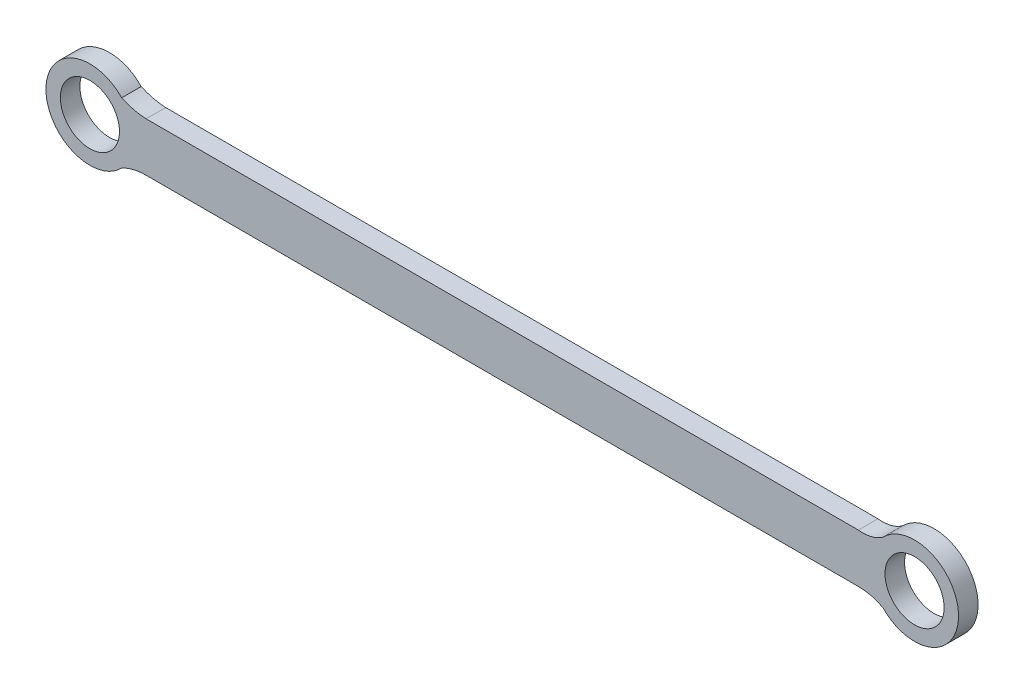
ISO-10303-21;
HEADER;
FILE_DESCRIPTION(('STEP AP214'),'2;1');
FILE_NAME('part.step','',(''),(''),'','','');
FILE_SCHEMA(('AUTOMOTIVE_DESIGN { 1 0 10303 214 1 1 1 1 }'));
ENDSEC;
DATA;
#1=APPLICATION_CONTEXT('core data for automotive mechanical design processes');
#2=APPLICATION_PROTOCOL_DEFINITION('international standard','automotive_design',2000,#1);
#3=PRODUCT_CONTEXT('',#1,'mechanical');
#4=PRODUCT('Part','Part','',(#3));
#5=PRODUCT_RELATED_PRODUCT_CATEGORY('part','',(#4));
#6=PRODUCT_DEFINITION_FORMATION('','',#4);
#7=PRODUCT_DEFINITION_CONTEXT('part definition',#1,'design');
#8=PRODUCT_DEFINITION('design','',#6,#7);
#9=PRODUCT_DEFINITION_SHAPE('','',#8);
#10=(LENGTH_UNIT() NAMED_UNIT(*) SI_UNIT(.MILLI.,.METRE.));
#11=(NAMED_UNIT(*) PLANE_ANGLE_UNIT() SI_UNIT($,.RADIAN.));
#12=(NAMED_UNIT(*) SI_UNIT($,.STERADIAN.) SOLID_ANGLE_UNIT());
#13=UNCERTAINTY_MEASURE_WITH_UNIT(LENGTH_MEASURE(1.E-05),#10,'distance_accuracy_value','');
#14=(GEOMETRIC_REPRESENTATION_CONTEXT(3) GLOBAL_UNCERTAINTY_ASSIGNED_CONTEXT((#13)) GLOBAL_UNIT_ASSIGNED_CONTEXT((#10,
#11,#12)) REPRESENTATION_CONTEXT('',''));
#15=CARTESIAN_POINT('',(0.,0.,0.));
#16=DIRECTION('',(0.,0.,1.));
#17=DIRECTION('',(1.,0.,0.));
#18=AXIS2_PLACEMENT_3D('',#15,#16,#17);
#19=CARTESIAN_POINT('',(82.9284754578231,11.5187030014296,4.));
#20=DIRECTION('',(0.,0.,1.));
#21=DIRECTION('',(1.,0.,0.));
#22=AXIS2_PLACEMENT_3D('',#19,#20,#21);
#23=PLANE('',#22);
#24=CARTESIAN_POINT('',(-75.25189842,-0.499050790722363,4.));
#25=DIRECTION('',(0.,0.,1.));
#26=DIRECTION('',(1.,0.,0.));
#27=AXIS2_PLACEMENT_3D('',#24,#25,#26);
#28=CIRCLE('',#27,6.05);
#29=CARTESIAN_POINT('',(-69.20189842,-0.499050790722363,4.));
#30=VERTEX_POINT('',#29);
#31=EDGE_CURVE('E175',#30,#30,#28,.T.);
#32=ORIENTED_EDGE('',*,*,#31,.F.);
#33=EDGE_LOOP('',(#32));
#34=FACE_BOUND('',#33,.T.);
#35=CARTESIAN_POINT('',(82.9284754578231,11.5187030014296,4.));
#36=DIRECTION('',(0.,0.,-1.));
#37=DIRECTION('',(1.,0.,0.));
#38=AXIS2_PLACEMENT_3D('',#35,#36,#37);
#39=CIRCLE('',#38,7.07890775212126);
#40=CARTESIAN_POINT('',(87.,5.7278807052877,4.));
#41=VERTEX_POINT('',#40);
#42=CARTESIAN_POINT('',(82.,4.50094920927764,4.));
#43=VERTEX_POINT('',#42);
#44=EDGE_CURVE('E168',#41,#43,#39,.T.);
#45=ORIENTED_EDGE('',*,*,#44,.T.);
#46=DIRECTION('',(-1.,0.,0.));
#47=VECTOR('',#46,1.);
#48=CARTESIAN_POINT('',(82.,4.50094920927764,4.));
#49=LINE('',#48,#47);
#50=CARTESIAN_POINT('',(-63.75,4.50094920927762,4.));
#51=VERTEX_POINT('',#50);
#52=EDGE_CURVE('E102',#43,#51,#49,.T.);
#53=ORIENTED_EDGE('',*,*,#52,.T.);
#54=CARTESIAN_POINT('',(-63.1540249134477,17.7700732969457,4.));
#55=DIRECTION('',(0.,0.,-1.));
#56=DIRECTION('',(1.,0.,0.));
#57=AXIS2_PLACEMENT_3D('',#54,#55,#56);
#58=CIRCLE('',#57,13.2825012839346);
#59=CARTESIAN_POINT('',(-68.75,5.72391610104252,4.));
#60=VERTEX_POINT('',#59);
#61=EDGE_CURVE('E158',#51,#60,#58,.T.);
#62=ORIENTED_EDGE('',*,*,#61,.T.);
#63=CARTESIAN_POINT('',(-75.25189842,-0.499050790722363,4.));
#64=DIRECTION('',(0.,0.,1.));
#65=DIRECTION('',(1.,0.,0.));
#66=AXIS2_PLACEMENT_3D('',#63,#64,#65);
#67=CIRCLE('',#66,9.);
#68=CARTESIAN_POINT('',(-68.75,-6.72201768248724,4.));
#69=VERTEX_POINT('',#68);
#70=EDGE_CURVE('E154',#60,#69,#67,.T.);
#71=ORIENTED_EDGE('',*,*,#70,.T.);
#72=CARTESIAN_POINT('',(-63.8571956674328,-15.8933188266036,4.));
#73=DIRECTION('',(0.,0.,-1.));
#74=DIRECTION('',(1.,0.,0.));
#75=AXIS2_PLACEMENT_3D('',#72,#73,#74);
#76=CIRCLE('',#75,10.3948207734842);
#77=CARTESIAN_POINT('',(-63.75,-5.49905079072237,4.));
#78=VERTEX_POINT('',#77);
#79=EDGE_CURVE('E121',#69,#78,#76,.T.);
#80=ORIENTED_EDGE('',*,*,#79,.T.);
#81=DIRECTION('',(1.,0.,0.));
#82=VECTOR('',#81,1.);
#83=CARTESIAN_POINT('',(-63.75,-5.49905079072237,4.));
#84=LINE('',#83,#82);
#85=CARTESIAN_POINT('',(82.,-5.49905079072237,4.));
#86=VERTEX_POINT('',#85);
#87=EDGE_CURVE('E115',#78,#86,#84,.T.);
#88=ORIENTED_EDGE('',*,*,#87,.T.);
#89=CARTESIAN_POINT('',(82.,-16.3005344033348,4.));
#90=DIRECTION('',(0.,0.,-1.));
#91=DIRECTION('',(1.,0.,0.));
#92=AXIS2_PLACEMENT_3D('',#89,#90,#91);
#93=CIRCLE('',#92,10.8014836126124);
#94=CARTESIAN_POINT('',(87.,-6.72598228673243,4.));
#95=VERTEX_POINT('',#94);
#96=EDGE_CURVE('E119',#86,#95,#93,.T.);
#97=ORIENTED_EDGE('',*,*,#96,.T.);
#98=CARTESIAN_POINT('',(93.49810158,-0.499050790722363,4.));
#99=DIRECTION('',(0.,0.,1.));
#100=DIRECTION('',(1.,0.,0.));
#101=AXIS2_PLACEMENT_3D('',#98,#99,#100);
#102=CIRCLE('',#101,9.00000000000002);
#103=EDGE_CURVE('E59',#95,#41,#102,.T.);
#104=ORIENTED_EDGE('',*,*,#103,.T.);
#105=EDGE_LOOP('',(#45,#53,#62,#71,#80,#88,#97,#104));
#106=FACE_BOUND('',#105,.T.);
#107=CARTESIAN_POINT('',(93.49810158,-0.499050790722363,4.));
#108=DIRECTION('',(0.,0.,1.));
#109=DIRECTION('',(1.,0.,0.));
#110=AXIS2_PLACEMENT_3D('',#107,#108,#109);
#111=CIRCLE('',#110,6.05);
#112=CARTESIAN_POINT('',(99.54810158,-0.499050790722363,4.));
#113=VERTEX_POINT('',#112);
#114=EDGE_CURVE('E176',#113,#113,#111,.T.);
#115=ORIENTED_EDGE('',*,*,#114,.F.);
#116=EDGE_LOOP('',(#115));
#117=FACE_BOUND('',#116,.T.);
#118=ADVANCED_FACE('F42',(#34,#106,#117),#23,.T.);
#119=CARTESIAN_POINT('',(82.9284754578231,11.5187030014296,0.));
#120=DIRECTION('',(0.,0.,1.));
#121=DIRECTION('',(1.,0.,0.));
#122=AXIS2_PLACEMENT_3D('',#119,#120,#121);
#123=PLANE('',#122);
#124=CARTESIAN_POINT('',(82.9284754578231,11.5187030014296,0.));
#125=DIRECTION('',(0.,0.,-1.));
#126=DIRECTION('',(1.,0.,0.));
#127=AXIS2_PLACEMENT_3D('',#124,#125,#126);
#128=CIRCLE('',#127,7.07890775212126);
#129=CARTESIAN_POINT('',(87.,5.7278807052877,0.));
#130=VERTEX_POINT('',#129);
#131=CARTESIAN_POINT('',(82.,4.50094920927764,0.));
#132=VERTEX_POINT('',#131);
#133=EDGE_CURVE('E181',#130,#132,#128,.T.);
#134=ORIENTED_EDGE('',*,*,#133,.F.);
#135=CARTESIAN_POINT('',(93.49810158,-0.499050790722363,0.));
#136=DIRECTION('',(0.,0.,1.));
#137=DIRECTION('',(1.,0.,0.));
#138=AXIS2_PLACEMENT_3D('',#135,#136,#137);
#139=CIRCLE('',#138,9.00000000000002);
#140=CARTESIAN_POINT('',(87.,-6.72598228673243,0.));
#141=VERTEX_POINT('',#140);
#142=EDGE_CURVE('E94',#141,#130,#139,.T.);
#143=ORIENTED_EDGE('',*,*,#142,.F.);
#144=CARTESIAN_POINT('',(82.,-16.3005344033348,0.));
#145=DIRECTION('',(0.,0.,-1.));
#146=DIRECTION('',(1.,0.,0.));
#147=AXIS2_PLACEMENT_3D('',#144,#145,#146);
#148=CIRCLE('',#147,10.8014836126124);
#149=CARTESIAN_POINT('',(82.,-5.49905079072237,0.));
#150=VERTEX_POINT('',#149);
#151=EDGE_CURVE('E88',#150,#141,#148,.T.);
#152=ORIENTED_EDGE('',*,*,#151,.F.);
#153=DIRECTION('',(1.,0.,0.));
#154=VECTOR('',#153,1.);
#155=CARTESIAN_POINT('',(-63.75,-5.49905079072237,0.));
#156=LINE('',#155,#154);
#157=CARTESIAN_POINT('',(-63.75,-5.49905079072237,0.));
#158=VERTEX_POINT('',#157);
#159=EDGE_CURVE('E130',#158,#150,#156,.T.);
#160=ORIENTED_EDGE('',*,*,#159,.F.);
#161=CARTESIAN_POINT('',(-63.8571956674328,-15.8933188266036,0.));
#162=DIRECTION('',(0.,0.,-1.));
#163=DIRECTION('',(1.,0.,0.));
#164=AXIS2_PLACEMENT_3D('',#161,#162,#163);
#165=CIRCLE('',#164,10.3948207734842);
#166=CARTESIAN_POINT('',(-68.75,-6.72201768248724,0.));
#167=VERTEX_POINT('',#166);
#168=EDGE_CURVE('E252',#167,#158,#165,.T.);
#169=ORIENTED_EDGE('',*,*,#168,.F.);
#170=CARTESIAN_POINT('',(-75.25189842,-0.499050790722363,0.));
#171=DIRECTION('',(0.,0.,1.));
#172=DIRECTION('',(1.,0.,0.));
#173=AXIS2_PLACEMENT_3D('',#170,#171,#172);
#174=CIRCLE('',#173,9.);
#175=CARTESIAN_POINT('',(-68.75,5.72391610104252,0.));
#176=VERTEX_POINT('',#175);
#177=EDGE_CURVE('E249',#176,#167,#174,.T.);
#178=ORIENTED_EDGE('',*,*,#177,.F.);
#179=CARTESIAN_POINT('',(-63.1540249134477,17.7700732969457,0.));
#180=DIRECTION('',(0.,0.,-1.));
#181=DIRECTION('',(1.,0.,0.));
#182=AXIS2_PLACEMENT_3D('',#179,#180,#181);
#183=CIRCLE('',#182,13.2825012839346);
#184=CARTESIAN_POINT('',(-63.75,4.50094920927762,0.));
#185=VERTEX_POINT('',#184);
#186=EDGE_CURVE('E241',#185,#176,#183,.T.);
#187=ORIENTED_EDGE('',*,*,#186,.F.);
#188=DIRECTION('',(-1.,0.,0.));
#189=VECTOR('',#188,1.);
#190=CARTESIAN_POINT('',(82.,4.50094920927764,0.));
#191=LINE('',#190,#189);
#192=EDGE_CURVE('E233',#132,#185,#191,.T.);
#193=ORIENTED_EDGE('',*,*,#192,.F.);
#194=EDGE_LOOP('',(#134,#143,#152,#160,#169,#178,#187,#193));
#195=FACE_BOUND('',#194,.T.);
#196=CARTESIAN_POINT('',(-75.25189842,-0.499050790722363,0.));
#197=DIRECTION('',(0.,0.,1.));
#198=DIRECTION('',(1.,0.,0.));
#199=AXIS2_PLACEMENT_3D('',#196,#197,#198);
#200=CIRCLE('',#199,6.05);
#201=CARTESIAN_POINT('',(-69.20189842,-0.499050790722363,0.));
#202=VERTEX_POINT('',#201);
#203=EDGE_CURVE('E172',#202,#202,#200,.T.);
#204=ORIENTED_EDGE('',*,*,#203,.T.);
#205=EDGE_LOOP('',(#204));
#206=FACE_BOUND('',#205,.T.);
#207=CARTESIAN_POINT('',(93.49810158,-0.499050790722363,0.));
#208=DIRECTION('',(0.,0.,1.));
#209=DIRECTION('',(1.,0.,0.));
#210=AXIS2_PLACEMENT_3D('',#207,#208,#209);
#211=CIRCLE('',#210,6.05);
#212=CARTESIAN_POINT('',(99.54810158,-0.499050790722363,0.));
#213=VERTEX_POINT('',#212);
#214=EDGE_CURVE('E182',#213,#213,#211,.T.);
#215=ORIENTED_EDGE('',*,*,#214,.T.);
#216=EDGE_LOOP('',(#215));
#217=FACE_BOUND('',#216,.T.);
#218=ADVANCED_FACE('F196',(#195,#206,#217),#123,.F.);
#219=CARTESIAN_POINT('',(82.9284754578231,11.5187030014296,4.));
#220=DIRECTION('',(0.,0.,-1.));
#221=DIRECTION('',(-1.,0.,0.));
#222=AXIS2_PLACEMENT_3D('',#219,#220,#221);
#223=CYLINDRICAL_SURFACE('',#222,7.07890775212126);
#224=ORIENTED_EDGE('',*,*,#133,.T.);
#225=DIRECTION('',(0.,0.,-1.));
#226=VECTOR('',#225,1.);
#227=CARTESIAN_POINT('',(82.,4.50094920927764,4.));
#228=LINE('',#227,#226);
#229=EDGE_CURVE('E12',#43,#132,#228,.T.);
#230=ORIENTED_EDGE('',*,*,#229,.F.);
#231=ORIENTED_EDGE('',*,*,#44,.F.);
#232=DIRECTION('',(0.,0.,-1.));
#233=VECTOR('',#232,1.);
#234=CARTESIAN_POINT('',(87.,5.7278807052877,4.));
#235=LINE('',#234,#233);
#236=EDGE_CURVE('E139',#41,#130,#235,.T.);
#237=ORIENTED_EDGE('',*,*,#236,.T.);
#238=EDGE_LOOP('',(#224,#230,#231,#237));
#239=FACE_BOUND('',#238,.T.);
#240=ADVANCED_FACE('F44',(#239),#223,.F.);
#241=CARTESIAN_POINT('',(82.,4.50094920927764,4.));
#242=DIRECTION('',(0.,-1.,0.));
#243=DIRECTION('',(1.,0.,0.));
#244=AXIS2_PLACEMENT_3D('',#241,#242,#243);
#245=PLANE('',#244);
#246=ORIENTED_EDGE('',*,*,#192,.T.);
#247=DIRECTION('',(0.,0.,-1.));
#248=VECTOR('',#247,1.);
#249=CARTESIAN_POINT('',(-63.75,4.50094920927762,4.));
#250=LINE('',#249,#248);
#251=EDGE_CURVE('E51',#51,#185,#250,.T.);
#252=ORIENTED_EDGE('',*,*,#251,.F.);
#253=ORIENTED_EDGE('',*,*,#52,.F.);
#254=ORIENTED_EDGE('',*,*,#229,.T.);
#255=EDGE_LOOP('',(#246,#252,#253,#254));
#256=FACE_BOUND('',#255,.T.);
#257=ADVANCED_FACE('F226',(#256),#245,.F.);
#258=CARTESIAN_POINT('',(-63.1540249134477,17.7700732969457,4.));
#259=DIRECTION('',(0.,0.,-1.));
#260=DIRECTION('',(-1.,0.,0.));
#261=AXIS2_PLACEMENT_3D('',#258,#259,#260);
#262=CYLINDRICAL_SURFACE('',#261,13.2825012839346);
#263=ORIENTED_EDGE('',*,*,#186,.T.);
#264=DIRECTION('',(0.,0.,-1.));
#265=VECTOR('',#264,1.);
#266=CARTESIAN_POINT('',(-68.75,5.72391610104252,4.));
#267=LINE('',#266,#265);
#268=EDGE_CURVE('E245',#60,#176,#267,.T.);
#269=ORIENTED_EDGE('',*,*,#268,.F.);
#270=ORIENTED_EDGE('',*,*,#61,.F.);
#271=ORIENTED_EDGE('',*,*,#251,.T.);
#272=EDGE_LOOP('',(#263,#269,#270,#271));
#273=FACE_BOUND('',#272,.T.);
#274=ADVANCED_FACE('F223',(#273),#262,.F.);
#275=CARTESIAN_POINT('',(-75.25189842,-0.499050790722363,4.));
#276=DIRECTION('',(0.,0.,-1.));
#277=DIRECTION('',(-1.,0.,0.));
#278=AXIS2_PLACEMENT_3D('',#275,#276,#277);
#279=CYLINDRICAL_SURFACE('',#278,9.);
#280=ORIENTED_EDGE('',*,*,#177,.T.);
#281=DIRECTION('',(0.,0.,-1.));
#282=VECTOR('',#281,1.);
#283=CARTESIAN_POINT('',(-68.75,-6.72201768248724,4.));
#284=LINE('',#283,#282);
#285=EDGE_CURVE('E263',#69,#167,#284,.T.);
#286=ORIENTED_EDGE('',*,*,#285,.F.);
#287=ORIENTED_EDGE('',*,*,#70,.F.);
#288=ORIENTED_EDGE('',*,*,#268,.T.);
#289=EDGE_LOOP('',(#280,#286,#287,#288));
#290=FACE_BOUND('',#289,.T.);
#291=ADVANCED_FACE('F219',(#290),#279,.T.);
#292=CARTESIAN_POINT('',(-63.8571956674328,-15.8933188266036,4.));
#293=DIRECTION('',(0.,0.,-1.));
#294=DIRECTION('',(-1.,0.,0.));
#295=AXIS2_PLACEMENT_3D('',#292,#293,#294);
#296=CYLINDRICAL_SURFACE('',#295,10.3948207734842);
#297=ORIENTED_EDGE('',*,*,#168,.T.);
#298=DIRECTION('',(0.,0.,-1.));
#299=VECTOR('',#298,1.);
#300=CARTESIAN_POINT('',(-63.75,-5.49905079072237,4.));
#301=LINE('',#300,#299);
#302=EDGE_CURVE('E131',#78,#158,#301,.T.);
#303=ORIENTED_EDGE('',*,*,#302,.F.);
#304=ORIENTED_EDGE('',*,*,#79,.F.);
#305=ORIENTED_EDGE('',*,*,#285,.T.);
#306=EDGE_LOOP('',(#297,#303,#304,#305));
#307=FACE_BOUND('',#306,.T.);
#308=ADVANCED_FACE('F216',(#307),#296,.F.);
#309=CARTESIAN_POINT('',(-63.75,-5.49905079072237,4.));
#310=DIRECTION('',(0.,1.,0.));
#311=DIRECTION('',(0.,0.,1.));
#312=AXIS2_PLACEMENT_3D('',#309,#310,#311);
#313=PLANE('',#312);
#314=ORIENTED_EDGE('',*,*,#159,.T.);
#315=DIRECTION('',(0.,0.,-1.));
#316=VECTOR('',#315,1.);
#317=CARTESIAN_POINT('',(82.,-5.49905079072237,4.));
#318=LINE('',#317,#316);
#319=EDGE_CURVE('E127',#86,#150,#318,.T.);
#320=ORIENTED_EDGE('',*,*,#319,.F.);
#321=ORIENTED_EDGE('',*,*,#87,.F.);
#322=ORIENTED_EDGE('',*,*,#302,.T.);
#323=EDGE_LOOP('',(#314,#320,#321,#322));
#324=FACE_BOUND('',#323,.T.);
#325=ADVANCED_FACE('F128',(#324),#313,.F.);
#326=CARTESIAN_POINT('',(82.,-16.3005344033348,4.));
#327=DIRECTION('',(0.,0.,-1.));
#328=DIRECTION('',(-1.,0.,0.));
#329=AXIS2_PLACEMENT_3D('',#326,#327,#328);
#330=CYLINDRICAL_SURFACE('',#329,10.8014836126124);
#331=ORIENTED_EDGE('',*,*,#151,.T.);
#332=DIRECTION('',(0.,0.,-1.));
#333=VECTOR('',#332,1.);
#334=CARTESIAN_POINT('',(87.,-6.72598228673243,4.));
#335=LINE('',#334,#333);
#336=EDGE_CURVE('E132',#95,#141,#335,.T.);
#337=ORIENTED_EDGE('',*,*,#336,.F.);
#338=ORIENTED_EDGE('',*,*,#96,.F.);
#339=ORIENTED_EDGE('',*,*,#319,.T.);
#340=EDGE_LOOP('',(#331,#337,#338,#339));
#341=FACE_BOUND('',#340,.T.);
#342=ADVANCED_FACE('F134',(#341),#330,.F.);
#343=CARTESIAN_POINT('',(93.49810158,-0.499050790722363,4.));
#344=DIRECTION('',(0.,0.,-1.));
#345=DIRECTION('',(-1.,0.,0.));
#346=AXIS2_PLACEMENT_3D('',#343,#344,#345);
#347=CYLINDRICAL_SURFACE('',#346,9.00000000000002);
#348=ORIENTED_EDGE('',*,*,#142,.T.);
#349=ORIENTED_EDGE('',*,*,#236,.F.);
#350=ORIENTED_EDGE('',*,*,#103,.F.);
#351=ORIENTED_EDGE('',*,*,#336,.T.);
#352=EDGE_LOOP('',(#348,#349,#350,#351));
#353=FACE_BOUND('',#352,.T.);
#354=ADVANCED_FACE('F209',(#353),#347,.T.);
#355=CARTESIAN_POINT('',(-75.25189842,-0.499050790722363,4.));
#356=DIRECTION('',(0.,0.,-1.));
#357=DIRECTION('',(-1.,0.,0.));
#358=AXIS2_PLACEMENT_3D('',#355,#356,#357);
#359=CYLINDRICAL_SURFACE('',#358,6.05);
#360=ORIENTED_EDGE('',*,*,#31,.T.);
#361=EDGE_LOOP('',(#360));
#362=FACE_BOUND('',#361,.T.);
#363=ORIENTED_EDGE('',*,*,#203,.F.);
#364=EDGE_LOOP('',(#363));
#365=FACE_BOUND('',#364,.T.);
#366=ADVANCED_FACE('F206',(#362,#365),#359,.F.);
#367=CARTESIAN_POINT('',(93.49810158,-0.499050790722363,4.));
#368=DIRECTION('',(0.,0.,-1.));
#369=DIRECTION('',(-1.,0.,0.));
#370=AXIS2_PLACEMENT_3D('',#367,#368,#369);
#371=CYLINDRICAL_SURFACE('',#370,6.05);
#372=ORIENTED_EDGE('',*,*,#114,.T.);
#373=EDGE_LOOP('',(#372));
#374=FACE_BOUND('',#373,.T.);
#375=ORIENTED_EDGE('',*,*,#214,.F.);
#376=EDGE_LOOP('',(#375));
#377=FACE_BOUND('',#376,.T.);
#378=ADVANCED_FACE('F193',(#374,#377),#371,.F.);
#379=CLOSED_SHELL('',(#118,#218,#240,#257,#274,#291,#308,#325,#342,#354,#366,#378));
#380=MANIFOLD_SOLID_BREP('B2',#379);
#381=ADVANCED_BREP_SHAPE_REPRESENTATION('',(#18,#380),#14);
#382=SHAPE_DEFINITION_REPRESENTATION(#9,#381);
ENDSEC;
END-ISO-10303-21;
